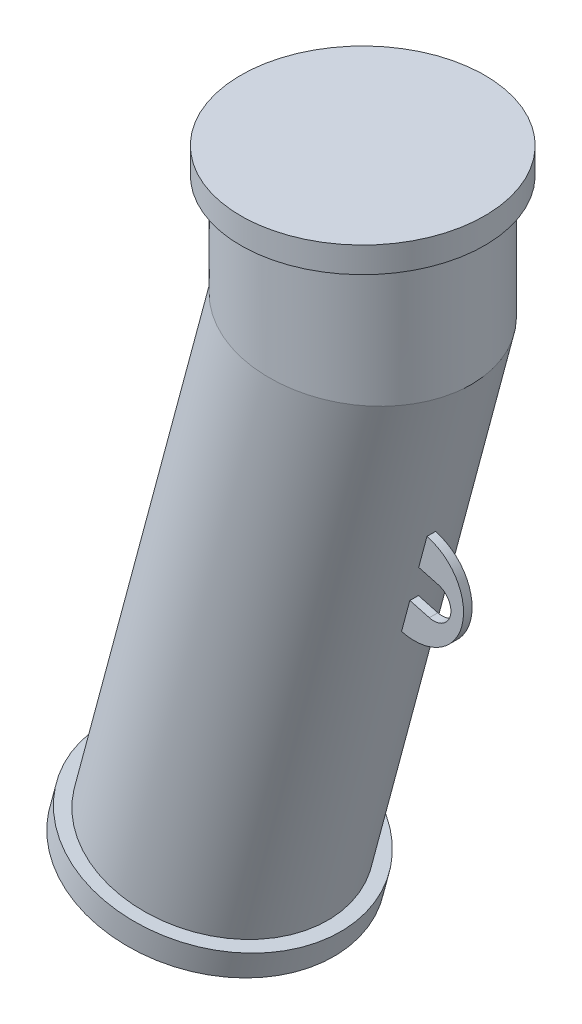
ISO-10303-21;
HEADER;
FILE_DESCRIPTION(('STEP AP214'),'2;1');
FILE_NAME('part.step','',(''),(''),'','','');
FILE_SCHEMA(('AUTOMOTIVE_DESIGN { 1 0 10303 214 1 1 1 1 }'));
ENDSEC;
DATA;
#1=APPLICATION_CONTEXT('core data for automotive mechanical design processes');
#2=APPLICATION_PROTOCOL_DEFINITION('international standard','automotive_design',2000,#1);
#3=PRODUCT_CONTEXT('',#1,'mechanical');
#4=PRODUCT('Part','Part','',(#3));
#5=PRODUCT_RELATED_PRODUCT_CATEGORY('part','',(#4));
#6=PRODUCT_DEFINITION_FORMATION('','',#4);
#7=PRODUCT_DEFINITION_CONTEXT('part definition',#1,'design');
#8=PRODUCT_DEFINITION('design','',#6,#7);
#9=PRODUCT_DEFINITION_SHAPE('','',#8);
#10=(LENGTH_UNIT() NAMED_UNIT(*) SI_UNIT(.MILLI.,.METRE.));
#11=(NAMED_UNIT(*) PLANE_ANGLE_UNIT() SI_UNIT($,.RADIAN.));
#12=(NAMED_UNIT(*) SI_UNIT($,.STERADIAN.) SOLID_ANGLE_UNIT());
#13=UNCERTAINTY_MEASURE_WITH_UNIT(LENGTH_MEASURE(1.E-05),#10,'distance_accuracy_value','');
#14=(GEOMETRIC_REPRESENTATION_CONTEXT(3) GLOBAL_UNCERTAINTY_ASSIGNED_CONTEXT((#13)) GLOBAL_UNIT_ASSIGNED_CONTEXT((#10,
#11,#12)) REPRESENTATION_CONTEXT('',''));
#15=CARTESIAN_POINT('',(0.,0.,0.));
#16=DIRECTION('',(0.,0.,1.));
#17=DIRECTION('',(1.,0.,0.));
#18=AXIS2_PLACEMENT_3D('',#15,#16,#17);
#19=CARTESIAN_POINT('',(-95.6613645989103,-759.954897245026,29.08394085975));
#20=DIRECTION('',(-0.258819045102508,-0.965925826289071,0.));
#21=DIRECTION('',(0.369643810614397,-0.0990457605412857,-0.923879532511309));
#22=AXIS2_PLACEMENT_3D('',#19,#20,#21);
#23=PLANE('',#22);
#24=CARTESIAN_POINT('',(-163.483696262181,-741.781958247051,1.65769548314787E-12));
#25=DIRECTION('',(0.258819045102508,0.965925826289071,0.));
#26=DIRECTION('',(-0.369643810614397,0.0990457605412857,0.923879532511309));
#27=AXIS2_PLACEMENT_3D('',#24,#25,#26);
#28=CIRCLE('',#27,142.5);
#29=CARTESIAN_POINT('',(-216.157939274733,-727.667937369918,131.652833382863));
#30=VERTEX_POINT('',#29);
#31=EDGE_CURVE('E10',#30,#30,#28,.T.);
#32=ORIENTED_EDGE('',*,*,#31,.T.);
#33=EDGE_LOOP('',(#32));
#34=FACE_BOUND('',#33,.T.);
#35=CARTESIAN_POINT('',(-163.483696262193,-741.781958247057,0.));
#36=DIRECTION('',(-0.258819045102522,-0.965925826289068,0.));
#37=DIRECTION('',(0.,0.,-1.));
#38=AXIS2_PLACEMENT_3D('',#35,#36,#37);
#39=CIRCLE('',#38,127.);
#40=CARTESIAN_POINT('',(-163.483696262193,-741.781958247057,-127.));
#41=VERTEX_POINT('',#40);
#42=EDGE_CURVE('E307',#41,#41,#39,.T.);
#43=ORIENTED_EDGE('',*,*,#42,.T.);
#44=EDGE_LOOP('',(#43));
#45=FACE_BOUND('',#44,.T.);
#46=ADVANCED_FACE('F17',(#34,#45),#23,.F.);
#47=CARTESIAN_POINT('',(-163.483696262181,-741.781958247051,1.65769548314787E-12));
#48=DIRECTION('',(0.258819045102508,0.965925826289071,0.));
#49=DIRECTION('',(-0.369643810614397,0.0990457605412857,0.923879532511309));
#50=AXIS2_PLACEMENT_3D('',#47,#48,#49);
#51=CYLINDRICAL_SURFACE('',#50,142.5);
#52=ORIENTED_EDGE('',*,*,#31,.F.);
#53=EDGE_LOOP('',(#52));
#54=FACE_BOUND('',#53,.T.);
#55=CARTESIAN_POINT('',(-171.248267615256,-770.759733035724,2.98976650334682E-12));
#56=DIRECTION('',(0.258819045102508,0.965925826289071,0.));
#57=DIRECTION('',(-0.369643810614397,0.0990457605412857,0.923879532511309));
#58=AXIS2_PLACEMENT_3D('',#55,#56,#57);
#59=CIRCLE('',#58,142.5);
#60=CARTESIAN_POINT('',(-223.922510627807,-756.645712158591,131.652833382865));
#61=VERTEX_POINT('',#60);
#62=EDGE_CURVE('E26',#61,#61,#59,.T.);
#63=ORIENTED_EDGE('',*,*,#62,.T.);
#64=EDGE_LOOP('',(#63));
#65=FACE_BOUND('',#64,.T.);
#66=ADVANCED_FACE('F397',(#54,#65),#51,.T.);
#67=CARTESIAN_POINT('',(-163.483696262193,-741.781958247057,0.));
#68=DIRECTION('',(0.258819045102522,0.965925826289068,0.));
#69=DIRECTION('',(-0.965925826289068,0.258819045102522,0.));
#70=AXIS2_PLACEMENT_3D('',#67,#68,#69);
#71=CYLINDRICAL_SURFACE('',#70,127.);
#72=CARTESIAN_POINT('',(50.3275105863922,-434.137557581643,4.99999999999997));
#73=CARTESIAN_POINT('',(50.3909015789031,-434.154601332665,3.33333333333331));
#74=CARTESIAN_POINT('',(50.4225970751586,-434.163123208177,1.66666666666665));
#75=CARTESIAN_POINT('',(50.4225970751586,-434.163123208177,-1.66666666666667));
#76=CARTESIAN_POINT('',(50.3909015789031,-434.154601332665,-3.33333333333333));
#77=CARTESIAN_POINT('',(50.3275105863922,-434.137557581643,-4.99999999999998));
#78=B_SPLINE_CURVE_WITH_KNOTS('',3,(#72,#73,#74,#75,#76,#77),.UNSPECIFIED.,.F.,.F.,(4,2,4),(0.,
5.00096941018497,10.0019388203699),.UNSPECIFIED.);
#79=CARTESIAN_POINT('',(50.3275105863922,-434.137557581643,4.99999999999997));
#80=VERTEX_POINT('',#79);
#81=CARTESIAN_POINT('',(50.327510586392,-434.137557581643,-5.00000000000001));
#82=VERTEX_POINT('',#81);
#83=EDGE_CURVE('E45',#80,#82,#78,.T.);
#84=ORIENTED_EDGE('',*,*,#83,.F.);
#85=DIRECTION('',(0.258819045102522,0.965925826289068,0.));
#86=VECTOR('',#85,1.);
#87=CARTESIAN_POINT('',(-40.9062246319123,-774.626492780639,5.00000000000005));
#88=LINE('',#87,#86);
#89=CARTESIAN_POINT('',(60.0332029580722,-397.915420527899,4.99999999999994));
#90=VERTEX_POINT('',#89);
#91=EDGE_CURVE('E38',#80,#90,#88,.T.);
#92=ORIENTED_EDGE('',*,*,#91,.T.);
#93=CARTESIAN_POINT('',(-62.5442686722088,-365.070885994318,0.));
#94=DIRECTION('',(-0.25881904510251,-0.96592582628907,0.));
#95=DIRECTION('',(0.965925826289071,-0.25881904510251,0.));
#96=AXIS2_PLACEMENT_3D('',#93,#94,#95);
#97=CIRCLE('',#96,127.);
#98=CARTESIAN_POINT('',(60.0332029580721,-397.915420527899,-4.99999999999996));
#99=VERTEX_POINT('',#98);
#100=EDGE_CURVE('E353',#99,#90,#97,.T.);
#101=ORIENTED_EDGE('',*,*,#100,.F.);
#102=DIRECTION('',(0.258819045102522,0.965925826289068,0.));
#103=VECTOR('',#102,1.);
#104=CARTESIAN_POINT('',(-40.9062246319123,-774.626492780639,-4.9999999999999));
#105=LINE('',#104,#103);
#106=EDGE_CURVE('E320',#82,#99,#105,.T.);
#107=ORIENTED_EDGE('',*,*,#106,.F.);
#108=EDGE_LOOP('',(#84,#92,#101,#107));
#109=FACE_BOUND('',#108,.T.);
#110=CARTESIAN_POINT('',(-52.1915068681081,-326.433852942755,0.));
#111=DIRECTION('',(0.258819045102511,0.96592582628907,0.));
#112=DIRECTION('',(-0.965925826289071,0.258819045102511,0.));
#113=AXIS2_PLACEMENT_3D('',#110,#111,#112);
#114=CIRCLE('',#113,127.);
#115=CARTESIAN_POINT('',(70.3859647621728,-359.278387476337,4.99999999999995));
#116=VERTEX_POINT('',#115);
#117=CARTESIAN_POINT('',(70.3859647621729,-359.278387476337,-4.99999999999996));
#118=VERTEX_POINT('',#117);
#119=EDGE_CURVE('E329',#116,#118,#114,.T.);
#120=ORIENTED_EDGE('',*,*,#119,.F.);
#121=CARTESIAN_POINT('',(80.0916571338533,-323.056250422592,4.99999999999997));
#122=VERTEX_POINT('',#121);
#123=EDGE_CURVE('E354',#116,#122,#88,.T.);
#124=ORIENTED_EDGE('',*,*,#123,.T.);
#125=CARTESIAN_POINT('',(80.0916571338533,-323.056250422592,-4.99999999999999));
#126=CARTESIAN_POINT('',(80.1550772192502,-323.073185597487,-3.33333333333333));
#127=CARTESIAN_POINT('',(80.1867872619486,-323.081653184934,-1.66666666666667));
#128=CARTESIAN_POINT('',(80.1867872619486,-323.081653184934,1.66666666666665));
#129=CARTESIAN_POINT('',(80.1550772192501,-323.073185597487,3.33333333333331));
#130=CARTESIAN_POINT('',(80.0916571338533,-323.056250422593,4.99999999999996));
#131=B_SPLINE_CURVE_WITH_KNOTS('',3,(#125,#126,#127,#128,#129,#130),.UNSPECIFIED.,.F.,.F.,(4,2,
4),(0.,5.00096941018496,10.0019388203699),.UNSPECIFIED.);
#132=CARTESIAN_POINT('',(80.0916571338532,-323.056250422593,-5.00000000000001));
#133=VERTEX_POINT('',#132);
#134=EDGE_CURVE('E319',#133,#122,#131,.T.);
#135=ORIENTED_EDGE('',*,*,#134,.F.);
#136=EDGE_CURVE('E315',#118,#133,#105,.T.);
#137=ORIENTED_EDGE('',*,*,#136,.F.);
#138=EDGE_LOOP('',(#120,#124,#135,#137));
#139=FACE_BOUND('',#138,.T.);
#140=ORIENTED_EDGE('',*,*,#42,.F.);
#141=EDGE_LOOP('',(#140));
#142=FACE_BOUND('',#141,.T.);
#143=CARTESIAN_POINT('',(1.17961196366423E-13,-131.652497587396,0.));
#144=DIRECTION('',(0.130526192220051,0.99144486137381,0.));
#145=DIRECTION('',(0.991444861373811,-0.130526192220052,0.));
#146=AXIS2_PLACEMENT_3D('',#143,#144,#145);
#147=ELLIPSE('',#146,128.095877993679,127.);
#148=CARTESIAN_POINT('',(127.,-148.372364780996,0.));
#149=VERTEX_POINT('',#148);
#150=EDGE_CURVE('E311',#149,#149,#147,.T.);
#151=ORIENTED_EDGE('',*,*,#150,.F.);
#152=EDGE_LOOP('',(#151));
#153=FACE_BOUND('',#152,.T.);
#154=ADVANCED_FACE('F331',(#109,#139,#142,#153),#71,.T.);
#155=CARTESIAN_POINT('',(65.3046921685573,-378.622388196556,4.99999999999997));
#156=DIRECTION('',(0.,0.,-0.999999999999999));
#157=DIRECTION('',(-0.965925826289069,0.25881904510251,0.));
#158=AXIS2_PLACEMENT_3D('',#155,#156,#157);
#159=CYLINDRICAL_SURFACE('',#158,57.5);
#160=CARTESIAN_POINT('',(65.3046921685573,-378.622388196556,4.99999999999997));
#161=DIRECTION('',(0.,0.,0.999999999999999));
#162=DIRECTION('',(0.965925826289069,-0.25881904510251,0.));
#163=AXIS2_PLACEMENT_3D('',#160,#161,#162);
#164=CIRCLE('',#163,57.5);
#165=EDGE_CURVE('E284',#80,#122,#164,.T.);
#166=ORIENTED_EDGE('',*,*,#165,.F.);
#167=ORIENTED_EDGE('',*,*,#83,.T.);
#168=CARTESIAN_POINT('',(65.3046921685571,-378.622388196556,-5.00000000000001));
#169=DIRECTION('',(0.,0.,0.999999999999999));
#170=DIRECTION('',(0.965925826289069,-0.25881904510251,0.));
#171=AXIS2_PLACEMENT_3D('',#168,#169,#170);
#172=CIRCLE('',#171,57.5);
#173=EDGE_CURVE('E277',#82,#133,#172,.T.);
#174=ORIENTED_EDGE('',*,*,#173,.T.);
#175=ORIENTED_EDGE('',*,*,#134,.T.);
#176=EDGE_LOOP('',(#166,#167,#174,#175));
#177=FACE_BOUND('',#176,.T.);
#178=ADVANCED_FACE('F335',(#177),#159,.T.);
#179=CARTESIAN_POINT('',(88.0039490863505,-384.704635756466,4.99999999999995));
#180=DIRECTION('',(0.,0.,0.999999999999999));
#181=DIRECTION('',(0.965925826289069,-0.25881904510251,0.));
#182=AXIS2_PLACEMENT_3D('',#179,#180,#181);
#183=PLANE('',#182);
#184=ORIENTED_EDGE('',*,*,#91,.F.);
#185=ORIENTED_EDGE('',*,*,#165,.T.);
#186=ORIENTED_EDGE('',*,*,#123,.F.);
#187=DIRECTION('',(0.965925826289069,-0.25881904510251,0.));
#188=VECTOR('',#187,1.);
#189=CARTESIAN_POINT('',(70.4810730706073,-359.303871670775,4.99999999999997));
#190=LINE('',#189,#188);
#191=CARTESIAN_POINT('',(93.1803299884009,-365.386119230683,4.99999999999995));
#192=VERTEX_POINT('',#191);
#193=EDGE_CURVE('E273',#116,#192,#190,.T.);
#194=ORIENTED_EDGE('',*,*,#193,.T.);
#195=CARTESIAN_POINT('',(88.0039490863505,-384.704635756466,4.99999999999995));
#196=DIRECTION('',(0.,0.,-0.999999999999999));
#197=DIRECTION('',(0.965925826289069,-0.25881904510251,0.));
#198=AXIS2_PLACEMENT_3D('',#195,#196,#197);
#199=CIRCLE('',#198,20.);
#200=CARTESIAN_POINT('',(82.8275681843003,-404.023152282247,4.99999999999996));
#201=VERTEX_POINT('',#200);
#202=EDGE_CURVE('E276',#192,#201,#199,.T.);
#203=ORIENTED_EDGE('',*,*,#202,.T.);
#204=DIRECTION('',(-0.965925826289069,0.25881904510251,0.));
#205=VECTOR('',#204,1.);
#206=CARTESIAN_POINT('',(60.1283112665068,-397.940904722337,4.99999999999997));
#207=LINE('',#206,#205);
#208=EDGE_CURVE('E280',#201,#90,#207,.T.);
#209=ORIENTED_EDGE('',*,*,#208,.T.);
#210=EDGE_LOOP('',(#184,#185,#186,#194,#203,#209));
#211=FACE_BOUND('',#210,.T.);
#212=ADVANCED_FACE('F340',(#211),#183,.T.);
#213=CARTESIAN_POINT('',(88.0039490863506,-384.704635756466,-5.00000000000003));
#214=DIRECTION('',(0.,0.,0.999999999999999));
#215=DIRECTION('',(0.965925826289069,-0.25881904510251,0.));
#216=AXIS2_PLACEMENT_3D('',#213,#214,#215);
#217=PLANE('',#216);
#218=ORIENTED_EDGE('',*,*,#173,.F.);
#219=ORIENTED_EDGE('',*,*,#106,.T.);
#220=DIRECTION('',(-0.965925826289069,0.25881904510251,0.));
#221=VECTOR('',#220,1.);
#222=CARTESIAN_POINT('',(60.1283112665067,-397.940904722338,-5.00000000000001));
#223=LINE('',#222,#221);
#224=CARTESIAN_POINT('',(82.8275681843002,-404.023152282247,-5.00000000000002));
#225=VERTEX_POINT('',#224);
#226=EDGE_CURVE('E293',#225,#99,#223,.T.);
#227=ORIENTED_EDGE('',*,*,#226,.F.);
#228=CARTESIAN_POINT('',(88.0039490863506,-384.704635756466,-5.00000000000003));
#229=DIRECTION('',(0.,0.,-0.999999999999999));
#230=DIRECTION('',(0.965925826289069,-0.25881904510251,0.));
#231=AXIS2_PLACEMENT_3D('',#228,#229,#230);
#232=CIRCLE('',#231,20.);
#233=CARTESIAN_POINT('',(93.1803299884009,-365.386119230684,-5.00000000000003));
#234=VERTEX_POINT('',#233);
#235=EDGE_CURVE('E290',#234,#225,#232,.T.);
#236=ORIENTED_EDGE('',*,*,#235,.F.);
#237=DIRECTION('',(0.965925826289069,-0.25881904510251,0.));
#238=VECTOR('',#237,1.);
#239=CARTESIAN_POINT('',(70.4810730706072,-359.303871670775,-5.00000000000001));
#240=LINE('',#239,#238);
#241=EDGE_CURVE('E272',#118,#234,#240,.T.);
#242=ORIENTED_EDGE('',*,*,#241,.F.);
#243=ORIENTED_EDGE('',*,*,#136,.T.);
#244=EDGE_LOOP('',(#218,#219,#227,#236,#242,#243));
#245=FACE_BOUND('',#244,.T.);
#246=ADVANCED_FACE('F342',(#245),#217,.F.);
#247=CARTESIAN_POINT('',(70.4810730706073,-359.303871670775,4.99999999999997));
#248=DIRECTION('',(0.258819045102511,0.96592582628907,0.));
#249=DIRECTION('',(-0.965925826289069,0.25881904510251,0.));
#250=AXIS2_PLACEMENT_3D('',#247,#248,#249);
#251=PLANE('',#250);
#252=ORIENTED_EDGE('',*,*,#193,.F.);
#253=ORIENTED_EDGE('',*,*,#119,.T.);
#254=ORIENTED_EDGE('',*,*,#241,.T.);
#255=DIRECTION('',(0.,0.,-0.999999999999999));
#256=VECTOR('',#255,1.);
#257=CARTESIAN_POINT('',(93.1803299884009,-365.386119230683,4.99999999999995));
#258=LINE('',#257,#256);
#259=EDGE_CURVE('E303',#192,#234,#258,.T.);
#260=ORIENTED_EDGE('',*,*,#259,.F.);
#261=EDGE_LOOP('',(#252,#253,#254,#260));
#262=FACE_BOUND('',#261,.T.);
#263=ADVANCED_FACE('F381',(#262),#251,.F.);
#264=CARTESIAN_POINT('',(88.0039490863505,-384.704635756466,4.99999999999995));
#265=DIRECTION('',(0.,0.,-0.999999999999999));
#266=DIRECTION('',(-0.965925826289069,0.25881904510251,0.));
#267=AXIS2_PLACEMENT_3D('',#264,#265,#266);
#268=CYLINDRICAL_SURFACE('',#267,20.);
#269=ORIENTED_EDGE('',*,*,#235,.T.);
#270=DIRECTION('',(0.,0.,-0.999999999999999));
#271=VECTOR('',#270,1.);
#272=CARTESIAN_POINT('',(82.8275681843003,-404.023152282247,4.99999999999996));
#273=LINE('',#272,#271);
#274=EDGE_CURVE('E287',#201,#225,#273,.T.);
#275=ORIENTED_EDGE('',*,*,#274,.F.);
#276=ORIENTED_EDGE('',*,*,#202,.F.);
#277=ORIENTED_EDGE('',*,*,#259,.T.);
#278=EDGE_LOOP('',(#269,#275,#276,#277));
#279=FACE_BOUND('',#278,.T.);
#280=ADVANCED_FACE('F389',(#279),#268,.F.);
#281=CARTESIAN_POINT('',(60.1283112665068,-397.940904722337,4.99999999999997));
#282=DIRECTION('',(-0.25881904510251,-0.96592582628907,0.));
#283=DIRECTION('',(0.965925826289069,-0.25881904510251,0.));
#284=AXIS2_PLACEMENT_3D('',#281,#282,#283);
#285=PLANE('',#284);
#286=ORIENTED_EDGE('',*,*,#226,.T.);
#287=ORIENTED_EDGE('',*,*,#100,.T.);
#288=ORIENTED_EDGE('',*,*,#208,.F.);
#289=ORIENTED_EDGE('',*,*,#274,.T.);
#290=EDGE_LOOP('',(#286,#287,#288,#289));
#291=FACE_BOUND('',#290,.T.);
#292=ADVANCED_FACE('F344',(#291),#285,.F.);
#293=CARTESIAN_POINT('',(0.,-131.652497587396,0.));
#294=DIRECTION('',(0.,1.,0.));
#295=DIRECTION('',(0.,0.,1.));
#296=AXIS2_PLACEMENT_3D('',#293,#294,#295);
#297=CYLINDRICAL_SURFACE('',#296,127.);
#298=CARTESIAN_POINT('',(0.,0.,0.));
#299=DIRECTION('',(0.,-1.,0.));
#300=DIRECTION('',(0.,0.,-1.));
#301=AXIS2_PLACEMENT_3D('',#298,#299,#300);
#302=CIRCLE('',#301,127.);
#303=CARTESIAN_POINT('',(0.,0.,-127.));
#304=VERTEX_POINT('',#303);
#305=EDGE_CURVE('E268',#304,#304,#302,.T.);
#306=ORIENTED_EDGE('',*,*,#305,.T.);
#307=EDGE_LOOP('',(#306));
#308=FACE_BOUND('',#307,.T.);
#309=ORIENTED_EDGE('',*,*,#150,.T.);
#310=EDGE_LOOP('',(#309));
#311=FACE_BOUND('',#310,.T.);
#312=ADVANCED_FACE('F402',(#308,#311),#297,.T.);
#313=CARTESIAN_POINT('',(-70.2148444708592,6.66767336600093E-12,-29.0839408597462));
#314=DIRECTION('',(0.,1.,0.));
#315=DIRECTION('',(0.3826834323651,0.,-0.923879532511309));
#316=AXIS2_PLACEMENT_3D('',#313,#314,#315);
#317=PLANE('',#316);
#318=ORIENTED_EDGE('',*,*,#305,.F.);
#319=EDGE_LOOP('',(#318));
#320=FACE_BOUND('',#319,.T.);
#321=CARTESIAN_POINT('',(0.,0.,0.));
#322=DIRECTION('',(0.,-1.,0.));
#323=DIRECTION('',(-0.3826834323651,0.,0.923879532511309));
#324=AXIS2_PLACEMENT_3D('',#321,#322,#323);
#325=CIRCLE('',#324,142.5);
#326=CARTESIAN_POINT('',(-54.5323891120267,0.,131.652833382862));
#327=VERTEX_POINT('',#326);
#328=EDGE_CURVE('E264',#327,#327,#325,.T.);
#329=ORIENTED_EDGE('',*,*,#328,.T.);
#330=EDGE_LOOP('',(#329));
#331=FACE_BOUND('',#330,.T.);
#332=ADVANCED_FACE('F404',(#320,#331),#317,.F.);
#333=CARTESIAN_POINT('',(0.,0.,0.));
#334=DIRECTION('',(0.,-1.,0.));
#335=DIRECTION('',(-0.3826834323651,0.,0.923879532511309));
#336=AXIS2_PLACEMENT_3D('',#333,#334,#335);
#337=CYLINDRICAL_SURFACE('',#336,142.5);
#338=ORIENTED_EDGE('',*,*,#328,.F.);
#339=EDGE_LOOP('',(#338));
#340=FACE_BOUND('',#339,.T.);
#341=CARTESIAN_POINT('',(-1.46716398762016E-12,30.0000000000009,4.29842939782631E-13));
#342=DIRECTION('',(0.,-1.,0.));
#343=DIRECTION('',(-0.3826834323651,0.,0.923879532511309));
#344=AXIS2_PLACEMENT_3D('',#341,#342,#343);
#345=CIRCLE('',#344,142.5);
#346=CARTESIAN_POINT('',(-54.5323891120282,30.0000000000008,131.652833382862));
#347=VERTEX_POINT('',#346);
#348=EDGE_CURVE('E233',#347,#347,#345,.T.);
#349=ORIENTED_EDGE('',*,*,#348,.T.);
#350=EDGE_LOOP('',(#349));
#351=FACE_BOUND('',#350,.T.);
#352=ADVANCED_FACE('F412',(#340,#351),#337,.T.);
#353=CARTESIAN_POINT('',(-131.652833382863,30.0000000000065,-54.5323891120248));
#354=DIRECTION('',(0.,-1.,0.));
#355=DIRECTION('',(-0.3826834323651,0.,0.923879532511309));
#356=AXIS2_PLACEMENT_3D('',#353,#354,#355);
#357=PLANE('',#356);
#358=ORIENTED_EDGE('',*,*,#348,.F.);
#359=EDGE_LOOP('',(#358));
#360=FACE_BOUND('',#359,.T.);
#361=ADVANCED_FACE('F427',(#360),#357,.F.);
#362=CARTESIAN_POINT('',(-82.2314573072118,-794.611715470564,38.1726723784205));
#363=DIRECTION('',(0.258819045102508,0.965925826289071,0.));
#364=DIRECTION('',(-0.369643810614397,0.0990457605412857,0.923879532511309));
#365=AXIS2_PLACEMENT_3D('',#362,#363,#364);
#366=PLANE('',#365);
#367=ORIENTED_EDGE('',*,*,#62,.F.);
#368=EDGE_LOOP('',(#367));
#369=FACE_BOUND('',#368,.T.);
#370=ADVANCED_FACE('F425',(#369),#366,.F.);
#371=CLOSED_SHELL('',(#46,#66,#154,#178,#212,#246,#263,#280,#292,#312,#332,#352,#361,#370));
#372=CARTESIAN_POINT('',(-164.777791487695,-746.611587378503,2.93576713832356E-12));
#373=DIRECTION('',(-0.258819045102509,-0.965925826289072,0.));
#374=DIRECTION('',(0.965925826289072,-0.258819045102509,0.));
#375=AXIS2_PLACEMENT_3D('',#372,#373,#374);
#376=PLANE('',#375);
#377=CARTESIAN_POINT('',(-164.777791487695,-746.611587378503,1.66849535615254E-12));
#378=DIRECTION('',(-0.258819045102509,-0.965925826289072,0.));
#379=DIRECTION('',(0.965925826289072,-0.258819045102509,0.));
#380=AXIS2_PLACEMENT_3D('',#377,#378,#379);
#381=CIRCLE('',#380,76.);
#382=CARTESIAN_POINT('',(-91.3674286897258,-766.281834806294,1.66849535615254E-12));
#383=VERTEX_POINT('',#382);
#384=EDGE_CURVE('E191',#383,#383,#381,.F.);
#385=ORIENTED_EDGE('',*,*,#384,.T.);
#386=EDGE_LOOP('',(#385));
#387=FACE_BOUND('',#386,.T.);
#388=ADVANCED_FACE('F574',(#387),#376,.F.);
#389=CARTESIAN_POINT('',(-1.42701282932674E-12,5.00000000000658,3.826491098729E-13));
#390=DIRECTION('',(0.,1.,0.));
#391=DIRECTION('',(0.,0.,1.));
#392=AXIS2_PLACEMENT_3D('',#389,#390,#391);
#393=PLANE('',#392);
#394=CARTESIAN_POINT('',(0.,5.00000000000658,0.));
#395=DIRECTION('',(0.,1.,0.));
#396=DIRECTION('',(0.,0.,1.));
#397=AXIS2_PLACEMENT_3D('',#394,#395,#396);
#398=CIRCLE('',#397,76.);
#399=CARTESIAN_POINT('',(0.,5.00000000000644,76.));
#400=VERTEX_POINT('',#399);
#401=EDGE_CURVE('E178',#400,#400,#398,.F.);
#402=ORIENTED_EDGE('',*,*,#401,.T.);
#403=EDGE_LOOP('',(#402));
#404=FACE_BOUND('',#403,.T.);
#405=ADVANCED_FACE('F560',(#404),#393,.F.);
#406=CARTESIAN_POINT('',(0.,0.,0.));
#407=DIRECTION('',(0.,-1.,0.));
#408=DIRECTION('',(-0.3826834323651,0.,0.923879532511309));
#409=AXIS2_PLACEMENT_3D('',#406,#407,#408);
#410=CYLINDRICAL_SURFACE('',#409,76.);
#411=CARTESIAN_POINT('',(2.28258002922504E-13,2.00000000000067,1.02131413259371E-13));
#412=DIRECTION('',(0.,1.,0.));
#413=DIRECTION('',(0.3826834323651,0.,-0.923879532511309));
#414=AXIS2_PLACEMENT_3D('',#411,#412,#413);
#415=CIRCLE('',#414,76.);
#416=CARTESIAN_POINT('',(29.0839408597478,2.00000000000071,-70.2148444708594));
#417=VERTEX_POINT('',#416);
#418=EDGE_CURVE('E202',#417,#417,#415,.F.);
#419=ORIENTED_EDGE('',*,*,#418,.T.);
#420=EDGE_LOOP('',(#419));
#421=FACE_BOUND('',#420,.T.);
#422=ORIENTED_EDGE('',*,*,#401,.F.);
#423=EDGE_LOOP('',(#422));
#424=FACE_BOUND('',#423,.T.);
#425=ADVANCED_FACE('F556',(#421,#424),#410,.F.);
#426=CARTESIAN_POINT('',(2.28258002922504E-13,2.00000000000067,1.02131413259371E-13));
#427=DIRECTION('',(0.,-1.,0.));
#428=DIRECTION('',(-0.3826834323651,0.,0.923879532511309));
#429=AXIS2_PLACEMENT_3D('',#426,#427,#428);
#430=CONICAL_SURFACE('',#429,76.,0.785398163397438);
#431=CARTESIAN_POINT('',(2.28579212188852E-13,1.80000000000067,1.01753862620093E-13));
#432=DIRECTION('',(0.,-1.,0.));
#433=DIRECTION('',(0.,0.,-1.));
#434=AXIS2_PLACEMENT_3D('',#431,#432,#433);
#435=CIRCLE('',#434,76.2);
#436=CARTESIAN_POINT('',(2.28579212188852E-13,1.80000000000082,-76.1999999999999));
#437=VERTEX_POINT('',#436);
#438=EDGE_CURVE('E198',#437,#437,#435,.F.);
#439=ORIENTED_EDGE('',*,*,#438,.F.);
#440=EDGE_LOOP('',(#439));
#441=FACE_BOUND('',#440,.T.);
#442=ORIENTED_EDGE('',*,*,#418,.F.);
#443=EDGE_LOOP('',(#442));
#444=FACE_BOUND('',#443,.T.);
#445=ADVANCED_FACE('F552',(#441,#444),#430,.F.);
#446=CARTESIAN_POINT('',(0.,10.,0.));
#447=DIRECTION('',(0.,-1.,0.));
#448=DIRECTION('',(1.,0.,0.));
#449=AXIS2_PLACEMENT_3D('',#446,#447,#448);
#450=CYLINDRICAL_SURFACE('',#449,76.2);
#451=ORIENTED_EDGE('',*,*,#438,.T.);
#452=EDGE_LOOP('',(#451));
#453=FACE_BOUND('',#452,.T.);
#454=CARTESIAN_POINT('',(0.,0.,0.));
#455=DIRECTION('',(0.,-1.,0.));
#456=DIRECTION('',(1.,0.,0.));
#457=AXIS2_PLACEMENT_3D('',#454,#455,#456);
#458=CIRCLE('',#457,76.2);
#459=CARTESIAN_POINT('',(76.2,0.,0.));
#460=VERTEX_POINT('',#459);
#461=EDGE_CURVE('E203',#460,#460,#458,.T.);
#462=ORIENTED_EDGE('',*,*,#461,.T.);
#463=EDGE_LOOP('',(#462));
#464=FACE_BOUND('',#463,.T.);
#465=ADVANCED_FACE('F555',(#453,#464),#450,.F.);
#466=CARTESIAN_POINT('',(-1000.,0.,0.));
#467=DIRECTION('',(0.,0.,-1.));
#468=DIRECTION('',(0.,1.,0.));
#469=AXIS2_PLACEMENT_3D('',#466,#467,#468);
#470=TOROIDAL_SURFACE('',#469,1000.,76.2);
#471=CARTESIAN_POINT('',(-34.0741737109319,-258.819045102521,0.));
#472=DIRECTION('',(-0.258819045102521,-0.965925826289068,0.));
#473=DIRECTION('',(0.965925826289068,-0.258819045102521,0.));
#474=AXIS2_PLACEMENT_3D('',#471,#472,#473);
#475=CIRCLE('',#474,76.2);
#476=CARTESIAN_POINT('',(39.5293742522951,-278.541056339334,0.));
#477=VERTEX_POINT('',#476);
#478=EDGE_CURVE('E197',#477,#477,#475,.T.);
#479=CARTESIAN_POINT('',(-1000.,0.,0.));
#480=DIRECTION('',(0.,0.,-1.));
#481=DIRECTION('',(0.,1.,0.));
#482=AXIS2_PLACEMENT_3D('',#479,#480,#481);
#483=CIRCLE('',#482,1076.2);
#484=EDGE_CURVE('',#460,#477,#483,.T.);
#485=ORIENTED_EDGE('',*,*,#461,.F.);
#486=ORIENTED_EDGE('',*,*,#478,.T.);
#487=ORIENTED_EDGE('',*,*,#484,.T.);
#488=ORIENTED_EDGE('',*,*,#484,.F.);
#489=EDGE_LOOP('',(#485,#487,#486,#488));
#490=FACE_BOUND('',#489,.T.);
#491=ADVANCED_FACE('F564',(#490),#470,.F.);
#492=CARTESIAN_POINT('',(-34.0741737109319,-258.819045102522,0.));
#493=DIRECTION('',(-0.258819045102522,-0.965925826289068,0.));
#494=DIRECTION('',(-0.933012701892219,0.250000000000001,0.258819045102521));
#495=AXIS2_PLACEMENT_3D('',#492,#493,#494);
#496=CYLINDRICAL_SURFACE('',#495,76.2);
#497=ORIENTED_EDGE('',*,*,#478,.F.);
#498=EDGE_LOOP('',(#497));
#499=FACE_BOUND('',#498,.T.);
#500=CARTESIAN_POINT('',(-163.949570543366,-743.520624734372,1.56745749191392E-12));
#501=DIRECTION('',(0.258819045102508,0.965925826289071,0.));
#502=DIRECTION('',(-0.965925826289072,0.258819045102509,0.));
#503=AXIS2_PLACEMENT_3D('',#500,#501,#502);
#504=CIRCLE('',#503,76.2);
#505=CARTESIAN_POINT('',(-237.553118506593,-723.798613497561,1.56745749191392E-12));
#506=VERTEX_POINT('',#505);
#507=EDGE_CURVE('E192',#506,#506,#504,.F.);
#508=ORIENTED_EDGE('',*,*,#507,.T.);
#509=EDGE_LOOP('',(#508));
#510=FACE_BOUND('',#509,.T.);
#511=ADVANCED_FACE('F546',(#499,#510),#496,.F.);
#512=CARTESIAN_POINT('',(-164.001334352386,-743.71380989963,1.56788948683411E-12));
#513=DIRECTION('',(0.258819045102508,0.965925826289071,0.));
#514=DIRECTION('',(-0.369643810614397,0.0990457605412857,0.923879532511309));
#515=AXIS2_PLACEMENT_3D('',#512,#513,#514);
#516=CONICAL_SURFACE('',#515,76.,0.785398163397438);
#517=ORIENTED_EDGE('',*,*,#507,.F.);
#518=EDGE_LOOP('',(#517));
#519=FACE_BOUND('',#518,.T.);
#520=CARTESIAN_POINT('',(-164.001334352386,-743.71380989963,1.56788948683411E-12));
#521=DIRECTION('',(-0.258819045102508,-0.965925826289071,0.));
#522=DIRECTION('',(0.369643810614397,-0.0990457605412857,-0.923879532511309));
#523=AXIS2_PLACEMENT_3D('',#520,#521,#522);
#524=CIRCLE('',#523,76.);
#525=CARTESIAN_POINT('',(-135.908404745692,-751.241287700768,-70.214844470858));
#526=VERTEX_POINT('',#525);
#527=EDGE_CURVE('E196',#526,#526,#524,.F.);
#528=ORIENTED_EDGE('',*,*,#527,.F.);
#529=EDGE_LOOP('',(#528));
#530=FACE_BOUND('',#529,.T.);
#531=ADVANCED_FACE('F542',(#519,#530),#516,.F.);
#532=CARTESIAN_POINT('',(-163.483696262181,-741.781958247051,1.65769548314787E-12));
#533=DIRECTION('',(0.258819045102508,0.965925826289071,0.));
#534=DIRECTION('',(-0.369643810614397,0.0990457605412857,0.923879532511309));
#535=AXIS2_PLACEMENT_3D('',#532,#533,#534);
#536=CYLINDRICAL_SURFACE('',#535,76.);
#537=ORIENTED_EDGE('',*,*,#527,.T.);
#538=EDGE_LOOP('',(#537));
#539=FACE_BOUND('',#538,.T.);
#540=ORIENTED_EDGE('',*,*,#384,.F.);
#541=EDGE_LOOP('',(#540));
#542=FACE_BOUND('',#541,.T.);
#543=ADVANCED_FACE('F545',(#539,#542),#536,.F.);
#544=CLOSED_SHELL('',(#388,#405,#425,#445,#465,#491,#511,#531,#543));
#545=CARTESIAN_POINT('',(-45.9220118838119,5.00000000000672,-110.865543901357));
#546=DIRECTION('',(0.,1.,0.));
#547=DIRECTION('',(0.,0.,1.));
#548=AXIS2_PLACEMENT_3D('',#545,#546,#547);
#549=PLANE('',#548);
#550=CARTESIAN_POINT('',(-45.9220118838128,5.00000000000672,-110.865543901357));
#551=DIRECTION('',(0.,1.,0.));
#552=DIRECTION('',(0.,0.,1.));
#553=AXIS2_PLACEMENT_3D('',#550,#551,#552);
#554=CIRCLE('',#553,5.42144103529902);
#555=CARTESIAN_POINT('',(-45.9220118838128,5.00000000000671,-105.444102866058));
#556=VERTEX_POINT('',#555);
#557=EDGE_CURVE('E186',#556,#556,#554,.F.);
#558=ORIENTED_EDGE('',*,*,#557,.T.);
#559=EDGE_LOOP('',(#558));
#560=FACE_BOUND('',#559,.T.);
#561=ADVANCED_FACE('F581',(#560),#549,.F.);
#562=CARTESIAN_POINT('',(-45.9220118838128,7.00000000000668,-110.865543901357));
#563=DIRECTION('',(0.,1.,0.));
#564=DIRECTION('',(0.923879532511311,0.,-0.382683432365097));
#565=AXIS2_PLACEMENT_3D('',#562,#563,#564);
#566=CONICAL_SURFACE('',#565,8.74999999999998,1.02974425867665);
#567=CARTESIAN_POINT('',(-45.9220118838114,1.74246958351599,-110.865543901356));
#568=VERTEX_POINT('',#567);
#569=VERTEX_LOOP('',#568);
#570=FACE_BOUND('',#569,.T.);
#571=ORIENTED_EDGE('',*,*,#557,.F.);
#572=EDGE_LOOP('',(#571));
#573=FACE_BOUND('',#572,.T.);
#574=ADVANCED_FACE('F578',(#570,#573),#566,.F.);
#575=CLOSED_SHELL('',(#561,#574));
#576=CARTESIAN_POINT('',(45.9220118838111,5.00000000000687,-110.865543901355));
#577=DIRECTION('',(0.,1.,0.));
#578=DIRECTION('',(0.,0.,1.));
#579=AXIS2_PLACEMENT_3D('',#576,#577,#578);
#580=PLANE('',#579);
#581=CARTESIAN_POINT('',(45.9220118838117,5.00000000000687,-110.865543901356));
#582=DIRECTION('',(0.,1.,0.));
#583=DIRECTION('',(0.,0.,1.));
#584=AXIS2_PLACEMENT_3D('',#581,#582,#583);
#585=CIRCLE('',#584,5.42144103531128);
#586=CARTESIAN_POINT('',(45.9220118838117,5.00000000000686,-105.444102866045));
#587=VERTEX_POINT('',#586);
#588=EDGE_CURVE('E190',#587,#587,#585,.F.);
#589=ORIENTED_EDGE('',*,*,#588,.T.);
#590=EDGE_LOOP('',(#589));
#591=FACE_BOUND('',#590,.T.);
#592=ADVANCED_FACE('F525',(#591),#580,.F.);
#593=CARTESIAN_POINT('',(45.9220118838117,6.99999999999946,-110.865543901356));
#594=DIRECTION('',(0.,1.,0.));
#595=DIRECTION('',(0.92387953251131,0.,0.382683432365103));
#596=AXIS2_PLACEMENT_3D('',#593,#594,#595);
#597=CONICAL_SURFACE('',#596,8.74999999999998,1.02974425867665);
#598=CARTESIAN_POINT('',(45.9220118838118,1.7424695835091,-110.865543901356));
#599=VERTEX_POINT('',#598);
#600=VERTEX_LOOP('',#599);
#601=FACE_BOUND('',#600,.T.);
#602=ORIENTED_EDGE('',*,*,#588,.F.);
#603=EDGE_LOOP('',(#602));
#604=FACE_BOUND('',#603,.T.);
#605=ADVANCED_FACE('F522',(#601,#604),#597,.F.);
#606=CLOSED_SHELL('',(#592,#605));
#607=CARTESIAN_POINT('',(110.865543901355,5.00000000000685,-45.9220118838082));
#608=DIRECTION('',(0.,1.,0.));
#609=DIRECTION('',(0.,0.,1.));
#610=AXIS2_PLACEMENT_3D('',#607,#608,#609);
#611=PLANE('',#610);
#612=CARTESIAN_POINT('',(110.865543901355,5.00000000000685,-45.9220118838108));
#613=DIRECTION('',(0.,1.,0.));
#614=DIRECTION('',(0.,0.,1.));
#615=AXIS2_PLACEMENT_3D('',#612,#613,#614);
#616=CIRCLE('',#615,5.42144103530627);
#617=CARTESIAN_POINT('',(110.865543901355,5.00000000000684,-40.5005708485045));
#618=VERTEX_POINT('',#617);
#619=EDGE_CURVE('E222',#618,#618,#616,.F.);
#620=ORIENTED_EDGE('',*,*,#619,.T.);
#621=EDGE_LOOP('',(#620));
#622=FACE_BOUND('',#621,.T.);
#623=ADVANCED_FACE('F535',(#622),#611,.F.);
#624=CARTESIAN_POINT('',(110.865543901355,7.00000000000244,-45.9220118838108));
#625=DIRECTION('',(0.,1.,0.));
#626=DIRECTION('',(0.382683432365094,0.,0.923879532511311));
#627=AXIS2_PLACEMENT_3D('',#624,#625,#626);
#628=CONICAL_SURFACE('',#627,8.74999999999998,1.02974425867665);
#629=CARTESIAN_POINT('',(110.865543901356,1.74246958351265,-45.9220118838092));
#630=VERTEX_POINT('',#629);
#631=VERTEX_LOOP('',#630);
#632=FACE_BOUND('',#631,.T.);
#633=ORIENTED_EDGE('',*,*,#619,.F.);
#634=EDGE_LOOP('',(#633));
#635=FACE_BOUND('',#634,.T.);
#636=ADVANCED_FACE('F532',(#632,#635),#628,.F.);
#637=CLOSED_SHELL('',(#623,#636));
#638=CARTESIAN_POINT('',(110.865543901356,5.00000000000667,45.9220118838136));
#639=DIRECTION('',(0.,1.,0.));
#640=DIRECTION('',(0.,0.,1.));
#641=AXIS2_PLACEMENT_3D('',#638,#639,#640);
#642=PLANE('',#641);
#643=CARTESIAN_POINT('',(110.865543901356,5.00000000000667,45.9220118838127));
#644=DIRECTION('',(0.,1.,0.));
#645=DIRECTION('',(0.,0.,1.));
#646=AXIS2_PLACEMENT_3D('',#643,#644,#645);
#647=CIRCLE('',#646,5.42144103530119);
#648=CARTESIAN_POINT('',(110.865543901356,5.00000000000666,51.3434529191139));
#649=VERTEX_POINT('',#648);
#650=EDGE_CURVE('E174',#649,#649,#647,.F.);
#651=ORIENTED_EDGE('',*,*,#650,.T.);
#652=EDGE_LOOP('',(#651));
#653=FACE_BOUND('',#652,.T.);
#654=ADVANCED_FACE('F621',(#653),#642,.F.);
#655=CARTESIAN_POINT('',(110.865543901356,7.00000000000532,45.9220118838127));
#656=DIRECTION('',(0.,1.,0.));
#657=DIRECTION('',(-0.3826834323651,0.,0.923879532511309));
#658=AXIS2_PLACEMENT_3D('',#655,#656,#657);
#659=CONICAL_SURFACE('',#658,8.74999999999998,1.02974425867665);
#660=CARTESIAN_POINT('',(110.865543901356,1.74246958351475,45.9220118838134));
#661=VERTEX_POINT('',#660);
#662=VERTEX_LOOP('',#661);
#663=FACE_BOUND('',#662,.T.);
#664=ORIENTED_EDGE('',*,*,#650,.F.);
#665=EDGE_LOOP('',(#664));
#666=FACE_BOUND('',#665,.T.);
#667=ADVANCED_FACE('F618',(#663,#666),#659,.F.);
#668=CLOSED_SHELL('',(#654,#667));
#669=CARTESIAN_POINT('',(45.9220118838096,5.00000000000645,110.865543901359));
#670=DIRECTION('',(0.,1.,0.));
#671=DIRECTION('',(0.,0.,1.));
#672=AXIS2_PLACEMENT_3D('',#669,#670,#671);
#673=PLANE('',#672);
#674=CARTESIAN_POINT('',(45.9220118838101,5.00000000000645,110.865543901359));
#675=DIRECTION('',(0.,1.,0.));
#676=DIRECTION('',(0.,0.,1.));
#677=AXIS2_PLACEMENT_3D('',#674,#675,#676);
#678=CIRCLE('',#677,5.42144103530045);
#679=CARTESIAN_POINT('',(45.9220118838101,5.00000000000644,116.28698493666));
#680=VERTEX_POINT('',#679);
#681=EDGE_CURVE('E179',#680,#680,#678,.F.);
#682=ORIENTED_EDGE('',*,*,#681,.T.);
#683=EDGE_LOOP('',(#682));
#684=FACE_BOUND('',#683,.T.);
#685=ADVANCED_FACE('F611',(#684),#673,.F.);
#686=CARTESIAN_POINT('',(45.9220118838101,7.00000000000555,110.865543901359));
#687=DIRECTION('',(0.,1.,0.));
#688=DIRECTION('',(-0.923879532511311,0.,0.382683432365091));
#689=AXIS2_PLACEMENT_3D('',#686,#687,#688);
#690=CONICAL_SURFACE('',#689,8.74999999999998,1.02974425867665);
#691=CARTESIAN_POINT('',(45.9220118838093,1.74246958351586,110.865543901358));
#692=VERTEX_POINT('',#691);
#693=VERTEX_LOOP('',#692);
#694=FACE_BOUND('',#693,.T.);
#695=ORIENTED_EDGE('',*,*,#681,.F.);
#696=EDGE_LOOP('',(#695));
#697=FACE_BOUND('',#696,.T.);
#698=ADVANCED_FACE('F608',(#694,#697),#690,.F.);
#699=CLOSED_SHELL('',(#685,#698));
#700=CARTESIAN_POINT('',(-45.922011883814,5.0000000000063,110.865543901357));
#701=DIRECTION('',(0.,1.,0.));
#702=DIRECTION('',(0.,0.,1.));
#703=AXIS2_PLACEMENT_3D('',#700,#701,#702);
#704=PLANE('',#703);
#705=CARTESIAN_POINT('',(-45.9220118838142,5.0000000000063,110.865543901355));
#706=DIRECTION('',(0.,1.,0.));
#707=DIRECTION('',(0.,0.,1.));
#708=AXIS2_PLACEMENT_3D('',#705,#706,#707);
#709=CIRCLE('',#708,5.42144103530924);
#710=CARTESIAN_POINT('',(-45.9220118838142,5.00000000000629,116.286984936664));
#711=VERTEX_POINT('',#710);
#712=EDGE_CURVE('E171',#711,#711,#709,.F.);
#713=ORIENTED_EDGE('',*,*,#712,.T.);
#714=EDGE_LOOP('',(#713));
#715=FACE_BOUND('',#714,.T.);
#716=ADVANCED_FACE('F601',(#715),#704,.F.);
#717=CARTESIAN_POINT('',(-45.9220118838142,7.00000000000011,110.865543901355));
#718=DIRECTION('',(0.,1.,0.));
#719=DIRECTION('',(-0.923879532511307,0.,-0.382683432365109));
#720=AXIS2_PLACEMENT_3D('',#717,#718,#719);
#721=CONICAL_SURFACE('',#720,8.74999999999998,1.02974425867665);
#722=CARTESIAN_POINT('',(-45.9220118838142,1.74246958350943,110.865543901359));
#723=VERTEX_POINT('',#722);
#724=VERTEX_LOOP('',#723);
#725=FACE_BOUND('',#724,.T.);
#726=ORIENTED_EDGE('',*,*,#712,.F.);
#727=EDGE_LOOP('',(#726));
#728=FACE_BOUND('',#727,.T.);
#729=ADVANCED_FACE('F598',(#725,#728),#721,.F.);
#730=CLOSED_SHELL('',(#716,#729));
#731=CARTESIAN_POINT('',(-110.865543901359,5.00000000000632,45.922011883812));
#732=DIRECTION('',(0.,1.,0.));
#733=DIRECTION('',(0.,0.,1.));
#734=AXIS2_PLACEMENT_3D('',#731,#732,#733);
#735=PLANE('',#734);
#736=CARTESIAN_POINT('',(-110.86554390136,5.00000000000632,45.9220118838121));
#737=DIRECTION('',(0.,1.,0.));
#738=DIRECTION('',(0.,0.,1.));
#739=AXIS2_PLACEMENT_3D('',#736,#737,#738);
#740=CIRCLE('',#739,5.42144103529651);
#741=CARTESIAN_POINT('',(-110.86554390136,5.00000000000631,51.3434529191086));
#742=VERTEX_POINT('',#741);
#743=EDGE_CURVE('E162',#742,#742,#740,.F.);
#744=ORIENTED_EDGE('',*,*,#743,.T.);
#745=EDGE_LOOP('',(#744));
#746=FACE_BOUND('',#745,.T.);
#747=ADVANCED_FACE('F591',(#746),#735,.F.);
#748=CARTESIAN_POINT('',(-110.86554390136,7.00000000000778,45.9220118838121));
#749=DIRECTION('',(0.,1.,0.));
#750=DIRECTION('',(-0.382683432365088,0.,-0.923879532511314));
#751=AXIS2_PLACEMENT_3D('',#748,#749,#750);
#752=CONICAL_SURFACE('',#751,8.74999999999998,1.02974425867665);
#753=CARTESIAN_POINT('',(-110.865543901358,1.74246958351843,45.9220118838127));
#754=VERTEX_POINT('',#753);
#755=VERTEX_LOOP('',#754);
#756=FACE_BOUND('',#755,.T.);
#757=ORIENTED_EDGE('',*,*,#743,.F.);
#758=EDGE_LOOP('',(#757));
#759=FACE_BOUND('',#758,.T.);
#760=ADVANCED_FACE('F588',(#756,#759),#752,.F.);
#761=CLOSED_SHELL('',(#747,#760));
#762=CARTESIAN_POINT('',(-110.865543901357,5.00000000000649,-45.9220118838119));
#763=DIRECTION('',(0.,1.,0.));
#764=DIRECTION('',(0.,0.,1.));
#765=AXIS2_PLACEMENT_3D('',#762,#763,#764);
#766=PLANE('',#765);
#767=CARTESIAN_POINT('',(-110.865543901358,5.00000000000649,-45.9220118838094));
#768=DIRECTION('',(0.,1.,0.));
#769=DIRECTION('',(0.,0.,1.));
#770=AXIS2_PLACEMENT_3D('',#767,#768,#769);
#771=CIRCLE('',#770,5.42144103529938);
#772=CARTESIAN_POINT('',(-110.865543901358,5.00000000000648,-40.5005708485101));
#773=VERTEX_POINT('',#772);
#774=EDGE_CURVE('E246',#773,#773,#771,.F.);
#775=ORIENTED_EDGE('',*,*,#774,.T.);
#776=EDGE_LOOP('',(#775));
#777=FACE_BOUND('',#776,.T.);
#778=ADVANCED_FACE('F455',(#777),#766,.F.);
#779=CARTESIAN_POINT('',(-110.865543901358,7.00000000000623,-45.9220118838094));
#780=DIRECTION('',(0.,1.,0.));
#781=DIRECTION('',(0.3826834323651,0.,-0.923879532511309));
#782=AXIS2_PLACEMENT_3D('',#779,#780,#781);
#783=CONICAL_SURFACE('',#782,8.74999999999998,1.02974425867665);
#784=CARTESIAN_POINT('',(-110.865543901357,1.74246958351577,-45.9220118838109));
#785=VERTEX_POINT('',#784);
#786=VERTEX_LOOP('',#785);
#787=FACE_BOUND('',#786,.T.);
#788=ORIENTED_EDGE('',*,*,#774,.F.);
#789=EDGE_LOOP('',(#788));
#790=FACE_BOUND('',#789,.T.);
#791=ADVANCED_FACE('F452',(#787,#790),#783,.F.);
#792=CLOSED_SHELL('',(#778,#791));
#793=CARTESIAN_POINT('',(-271.8656835876,-717.917473171183,45.922011883816));
#794=DIRECTION('',(-0.258819045102509,-0.965925826289072,0.));
#795=DIRECTION('',(0.965925826289072,-0.258819045102509,0.));
#796=AXIS2_PLACEMENT_3D('',#793,#794,#795);
#797=PLANE('',#796);
#798=CARTESIAN_POINT('',(-271.865683587601,-717.917473171183,45.9220118838161));
#799=DIRECTION('',(-0.258819045102509,-0.965925826289072,0.));
#800=DIRECTION('',(0.965925826289072,-0.258819045102509,0.));
#801=AXIS2_PLACEMENT_3D('',#798,#799,#800);
#802=CIRCLE('',#801,5.4214410353005);
#803=CARTESIAN_POINT('',(-266.628973675901,-719.320645363019,45.9220118838161));
#804=VERTEX_POINT('',#803);
#805=EDGE_CURVE('E251',#804,#804,#802,.F.);
#806=ORIENTED_EDGE('',*,*,#805,.T.);
#807=EDGE_LOOP('',(#806));
#808=FACE_BOUND('',#807,.T.);
#809=ADVANCED_FACE('F445',(#808),#797,.F.);
#810=CARTESIAN_POINT('',(-272.383321677806,-719.849324823761,45.9220118838161));
#811=DIRECTION('',(-0.258819045102508,-0.965925826289071,0.));
#812=DIRECTION('',(0.369643810614403,-0.0990457605412866,0.923879532511305));
#813=AXIS2_PLACEMENT_3D('',#810,#811,#812);
#814=CONICAL_SURFACE('',#813,8.74999999999998,1.02974425867665);
#815=CARTESIAN_POINT('',(-271.022572675811,-714.770940411973,45.9220118838159));
#816=VERTEX_POINT('',#815);
#817=VERTEX_LOOP('',#816);
#818=FACE_BOUND('',#817,.T.);
#819=ORIENTED_EDGE('',*,*,#805,.F.);
#820=EDGE_LOOP('',(#819));
#821=FACE_BOUND('',#820,.T.);
#822=ADVANCED_FACE('F442',(#818,#821),#814,.F.);
#823=CLOSED_SHELL('',(#809,#822));
#824=CARTESIAN_POINT('',(-271.865683587601,-717.917473171183,-45.9220118838082));
#825=DIRECTION('',(-0.258819045102509,-0.965925826289072,0.));
#826=DIRECTION('',(0.965925826289072,-0.258819045102509,0.));
#827=AXIS2_PLACEMENT_3D('',#824,#825,#826);
#828=PLANE('',#827);
#829=CARTESIAN_POINT('',(-271.865683587601,-717.917473171184,-45.9220118838092));
#830=DIRECTION('',(-0.258819045102509,-0.965925826289072,0.));
#831=DIRECTION('',(0.965925826289072,-0.258819045102509,0.));
#832=AXIS2_PLACEMENT_3D('',#829,#830,#831);
#833=CIRCLE('',#832,5.42144103530116);
#834=CARTESIAN_POINT('',(-266.6289736759,-719.32064536302,-45.9220118838092));
#835=VERTEX_POINT('',#834);
#836=EDGE_CURVE('E247',#835,#835,#833,.F.);
#837=ORIENTED_EDGE('',*,*,#836,.T.);
#838=EDGE_LOOP('',(#837));
#839=FACE_BOUND('',#838,.T.);
#840=ADVANCED_FACE('F475',(#839),#828,.F.);
#841=CARTESIAN_POINT('',(-272.383321677806,-719.84932482376,-45.9220118838092));
#842=DIRECTION('',(-0.258819045102508,-0.965925826289071,0.));
#843=DIRECTION('',(-0.369643810614397,0.0990457605412857,0.923879532511309));
#844=AXIS2_PLACEMENT_3D('',#841,#842,#843);
#845=CONICAL_SURFACE('',#844,8.74999999999998,1.02974425867665);
#846=CARTESIAN_POINT('',(-271.022572675812,-714.770940411972,-45.9220118838082));
#847=VERTEX_POINT('',#846);
#848=VERTEX_LOOP('',#847);
#849=FACE_BOUND('',#848,.T.);
#850=ORIENTED_EDGE('',*,*,#836,.F.);
#851=EDGE_LOOP('',(#850));
#852=FACE_BOUND('',#851,.T.);
#853=ADVANCED_FACE('F472',(#849,#852),#845,.F.);
#854=CLOSED_SHELL('',(#840,#853));
#855=CARTESIAN_POINT('',(-209.135048761424,-734.726096113549,-110.865543901352));
#856=DIRECTION('',(-0.258819045102509,-0.965925826289072,0.));
#857=DIRECTION('',(0.965925826289072,-0.258819045102509,0.));
#858=AXIS2_PLACEMENT_3D('',#855,#856,#857);
#859=PLANE('',#858);
#860=CARTESIAN_POINT('',(-209.135048761422,-734.726096113549,-110.865543901354));
#861=DIRECTION('',(-0.258819045102509,-0.965925826289072,0.));
#862=DIRECTION('',(0.965925826289072,-0.258819045102509,0.));
#863=AXIS2_PLACEMENT_3D('',#860,#861,#862);
#864=CIRCLE('',#863,5.42144103530645);
#865=CARTESIAN_POINT('',(-203.898338849717,-736.129268305387,-110.865543901354));
#866=VERTEX_POINT('',#865);
#867=EDGE_CURVE('E226',#866,#866,#864,.F.);
#868=ORIENTED_EDGE('',*,*,#867,.T.);
#869=EDGE_LOOP('',(#868));
#870=FACE_BOUND('',#869,.T.);
#871=ADVANCED_FACE('F465',(#870),#859,.F.);
#872=CARTESIAN_POINT('',(-209.652686851626,-736.657947766123,-110.865543901354));
#873=DIRECTION('',(-0.258819045102508,-0.965925826289071,0.));
#874=DIRECTION('',(-0.892399100832546,0.239117618394329,0.382683432365103));
#875=AXIS2_PLACEMENT_3D('',#872,#873,#874);
#876=CONICAL_SURFACE('',#875,8.74999999999998,1.02974425867665);
#877=CARTESIAN_POINT('',(-208.291937849634,-731.579563354335,-110.865543901353));
#878=VERTEX_POINT('',#877);
#879=VERTEX_LOOP('',#878);
#880=FACE_BOUND('',#879,.T.);
#881=ORIENTED_EDGE('',*,*,#867,.F.);
#882=EDGE_LOOP('',(#881));
#883=FACE_BOUND('',#882,.T.);
#884=ADVANCED_FACE('F462',(#880,#883),#876,.F.);
#885=CLOSED_SHELL('',(#871,#884));
#886=CARTESIAN_POINT('',(-120.420534213968,-758.497078643457,-110.865543901354));
#887=DIRECTION('',(-0.258819045102509,-0.965925826289072,0.));
#888=DIRECTION('',(0.965925826289072,-0.258819045102509,0.));
#889=AXIS2_PLACEMENT_3D('',#886,#887,#888);
#890=PLANE('',#889);
#891=CARTESIAN_POINT('',(-120.420534213968,-758.497078643457,-110.865543901355));
#892=DIRECTION('',(-0.258819045102509,-0.965925826289072,0.));
#893=DIRECTION('',(0.965925826289072,-0.258819045102509,0.));
#894=AXIS2_PLACEMENT_3D('',#891,#892,#893);
#895=CIRCLE('',#894,5.42144103531143);
#896=CARTESIAN_POINT('',(-115.183824302258,-759.900250835296,-110.865543901355));
#897=VERTEX_POINT('',#896);
#898=EDGE_CURVE('E242',#897,#897,#895,.F.);
#899=ORIENTED_EDGE('',*,*,#898,.T.);
#900=EDGE_LOOP('',(#899));
#901=FACE_BOUND('',#900,.T.);
#902=ADVANCED_FACE('F485',(#901),#890,.F.);
#903=CARTESIAN_POINT('',(-120.938172304171,-760.428930296028,-110.865543901355));
#904=DIRECTION('',(-0.258819045102508,-0.965925826289071,0.));
#905=DIRECTION('',(-0.89239910083255,0.23911761839433,-0.382683432365098));
#906=AXIS2_PLACEMENT_3D('',#903,#904,#905);
#907=CONICAL_SURFACE('',#906,8.74999999999998,1.02974425867665);
#908=CARTESIAN_POINT('',(-119.577423302178,-755.35054588424,-110.865543901354));
#909=VERTEX_POINT('',#908);
#910=VERTEX_LOOP('',#909);
#911=FACE_BOUND('',#910,.T.);
#912=ORIENTED_EDGE('',*,*,#898,.F.);
#913=EDGE_LOOP('',(#912));
#914=FACE_BOUND('',#913,.T.);
#915=ADVANCED_FACE('F482',(#911,#914),#907,.F.);
#916=CLOSED_SHELL('',(#902,#915));
#917=CARTESIAN_POINT('',(-57.6898993877897,-775.305701585823,-45.9220118838099));
#918=DIRECTION('',(-0.258819045102509,-0.965925826289072,0.));
#919=DIRECTION('',(0.965925826289072,-0.258819045102509,0.));
#920=AXIS2_PLACEMENT_3D('',#917,#918,#919);
#921=PLANE('',#920);
#922=CARTESIAN_POINT('',(-57.6898993877891,-775.305701585823,-45.9220118838092));
#923=DIRECTION('',(-0.258819045102509,-0.965925826289072,0.));
#924=DIRECTION('',(0.965925826289072,-0.258819045102509,0.));
#925=AXIS2_PLACEMENT_3D('',#922,#923,#924);
#926=CIRCLE('',#925,5.4214410352992);
#927=CARTESIAN_POINT('',(-52.4531894760903,-776.708873777658,-45.9220118838092));
#928=VERTEX_POINT('',#927);
#929=EDGE_CURVE('E238',#928,#928,#926,.F.);
#930=ORIENTED_EDGE('',*,*,#929,.T.);
#931=EDGE_LOOP('',(#930));
#932=FACE_BOUND('',#931,.T.);
#933=ADVANCED_FACE('F495',(#932),#921,.F.);
#934=CARTESIAN_POINT('',(-58.2075374779941,-777.237553238401,-45.9220118838092));
#935=DIRECTION('',(-0.258819045102508,-0.965925826289071,0.));
#936=DIRECTION('',(-0.369643810614398,0.0990457605412851,-0.923879532511309));
#937=AXIS2_PLACEMENT_3D('',#934,#935,#936);
#938=CONICAL_SURFACE('',#937,8.74999999999998,1.02974425867665);
#939=CARTESIAN_POINT('',(-56.8467884760018,-772.159168826612,-45.92201188381));
#940=VERTEX_POINT('',#939);
#941=VERTEX_LOOP('',#940);
#942=FACE_BOUND('',#941,.T.);
#943=ORIENTED_EDGE('',*,*,#929,.F.);
#944=EDGE_LOOP('',(#943));
#945=FACE_BOUND('',#944,.T.);
#946=ADVANCED_FACE('F492',(#942,#945),#938,.F.);
#947=CLOSED_SHELL('',(#933,#946));
#948=CARTESIAN_POINT('',(-57.6898993877896,-775.305701585822,45.9220118838137));
#949=DIRECTION('',(-0.258819045102509,-0.965925826289072,0.));
#950=DIRECTION('',(0.965925826289072,-0.258819045102509,0.));
#951=AXIS2_PLACEMENT_3D('',#948,#949,#950);
#952=PLANE('',#951);
#953=CARTESIAN_POINT('',(-57.6898993877909,-775.305701585822,45.9220118838159));
#954=DIRECTION('',(-0.258819045102509,-0.965925826289072,0.));
#955=DIRECTION('',(0.965925826289072,-0.258819045102509,0.));
#956=AXIS2_PLACEMENT_3D('',#953,#954,#955);
#957=CIRCLE('',#956,5.4214410352995);
#958=CARTESIAN_POINT('',(-52.4531894760917,-776.708873777658,45.9220118838159));
#959=VERTEX_POINT('',#958);
#960=EDGE_CURVE('E234',#959,#959,#957,.F.);
#961=ORIENTED_EDGE('',*,*,#960,.T.);
#962=EDGE_LOOP('',(#961));
#963=FACE_BOUND('',#962,.T.);
#964=ADVANCED_FACE('F505',(#963),#952,.F.);
#965=CARTESIAN_POINT('',(-58.2075374779958,-777.2375532384,45.9220118838159));
#966=DIRECTION('',(-0.258819045102508,-0.965925826289071,0.));
#967=DIRECTION('',(0.369643810614397,-0.0990457605412857,-0.923879532511309));
#968=AXIS2_PLACEMENT_3D('',#965,#966,#967);
#969=CONICAL_SURFACE('',#968,8.74999999999998,1.02974425867665);
#970=CARTESIAN_POINT('',(-56.8467884760018,-772.159168826612,45.9220118838144));
#971=VERTEX_POINT('',#970);
#972=VERTEX_LOOP('',#971);
#973=FACE_BOUND('',#972,.T.);
#974=ORIENTED_EDGE('',*,*,#960,.F.);
#975=EDGE_LOOP('',(#974));
#976=FACE_BOUND('',#975,.T.);
#977=ADVANCED_FACE('F502',(#973,#976),#969,.F.);
#978=CLOSED_SHELL('',(#964,#977));
#979=CARTESIAN_POINT('',(-120.420534213967,-758.497078643457,110.86554390136));
#980=DIRECTION('',(-0.258819045102509,-0.965925826289072,0.));
#981=DIRECTION('',(0.965925826289072,-0.258819045102509,0.));
#982=AXIS2_PLACEMENT_3D('',#979,#980,#981);
#983=PLANE('',#982);
#984=CARTESIAN_POINT('',(-120.420534213966,-758.497078643457,110.865543901361));
#985=DIRECTION('',(-0.258819045102509,-0.965925826289072,0.));
#986=DIRECTION('',(0.965925826289072,-0.258819045102509,0.));
#987=AXIS2_PLACEMENT_3D('',#984,#985,#986);
#988=CIRCLE('',#987,5.42144103529667);
#989=CARTESIAN_POINT('',(-115.18382430227,-759.900250835292,110.865543901361));
#990=VERTEX_POINT('',#989);
#991=EDGE_CURVE('E229',#990,#990,#988,.F.);
#992=ORIENTED_EDGE('',*,*,#991,.T.);
#993=EDGE_LOOP('',(#992));
#994=FACE_BOUND('',#993,.T.);
#995=ADVANCED_FACE('F515',(#994),#983,.F.);
#996=CARTESIAN_POINT('',(-120.938172304171,-760.428930296037,110.865543901361));
#997=DIRECTION('',(-0.258819045102508,-0.965925826289071,0.));
#998=DIRECTION('',(0.892399100832543,-0.239117618394329,-0.382683432365109));
#999=AXIS2_PLACEMENT_3D('',#996,#997,#998);
#1000=CONICAL_SURFACE('',#999,8.74999999999998,1.02974425867665);
#1001=CARTESIAN_POINT('',(-119.57742330218,-755.350545884249,110.86554390136));
#1002=VERTEX_POINT('',#1001);
#1003=VERTEX_LOOP('',#1002);
#1004=FACE_BOUND('',#1003,.T.);
#1005=ORIENTED_EDGE('',*,*,#991,.F.);
#1006=EDGE_LOOP('',(#1005));
#1007=FACE_BOUND('',#1006,.T.);
#1008=ADVANCED_FACE('F512',(#1004,#1007),#1000,.F.);
#1009=CLOSED_SHELL('',(#995,#1008));
#1010=CARTESIAN_POINT('',(-209.135048761421,-734.726096113549,110.86554390136));
#1011=DIRECTION('',(-0.258819045102509,-0.965925826289072,0.));
#1012=DIRECTION('',(0.965925826289072,-0.258819045102509,0.));
#1013=AXIS2_PLACEMENT_3D('',#1010,#1011,#1012);
#1014=PLANE('',#1013);
#1015=CARTESIAN_POINT('',(-209.13504876142,-734.726096113549,110.865543901359));
#1016=DIRECTION('',(-0.258819045102509,-0.965925826289072,0.));
#1017=DIRECTION('',(0.965925826289072,-0.258819045102509,0.));
#1018=AXIS2_PLACEMENT_3D('',#1015,#1016,#1017);
#1019=CIRCLE('',#1018,5.42144103530928);
#1020=CARTESIAN_POINT('',(-203.898338849711,-736.129268305388,110.865543901359));
#1021=VERTEX_POINT('',#1020);
#1022=EDGE_CURVE('E159',#1021,#1021,#1019,.F.);
#1023=ORIENTED_EDGE('',*,*,#1022,.T.);
#1024=EDGE_LOOP('',(#1023));
#1025=FACE_BOUND('',#1024,.T.);
#1026=ADVANCED_FACE('F153',(#1025),#1014,.F.);
#1027=CARTESIAN_POINT('',(-209.652686851623,-736.657947766121,110.865543901359));
#1028=DIRECTION('',(-0.258819045102508,-0.965925826289071,0.));
#1029=DIRECTION('',(0.892399100832552,-0.239117618394331,0.382683432365091));
#1030=AXIS2_PLACEMENT_3D('',#1027,#1028,#1029);
#1031=CONICAL_SURFACE('',#1030,8.74999999999998,1.02974425867665);
#1032=CARTESIAN_POINT('',(-208.291937849633,-731.579563354332,110.865543901362));
#1033=VERTEX_POINT('',#1032);
#1034=VERTEX_LOOP('',#1033);
#1035=FACE_BOUND('',#1034,.T.);
#1036=ORIENTED_EDGE('',*,*,#1022,.F.);
#1037=EDGE_LOOP('',(#1036));
#1038=FACE_BOUND('',#1037,.T.);
#1039=ADVANCED_FACE('F150',(#1035,#1038),#1031,.F.);
#1040=CLOSED_SHELL('',(#1026,#1039));
#1041=ORIENTED_CLOSED_SHELL('',*,#544,.T.);
#1042=ORIENTED_CLOSED_SHELL('',*,#575,.T.);
#1043=ORIENTED_CLOSED_SHELL('',*,#606,.T.);
#1044=ORIENTED_CLOSED_SHELL('',*,#637,.T.);
#1045=ORIENTED_CLOSED_SHELL('',*,#668,.T.);
#1046=ORIENTED_CLOSED_SHELL('',*,#699,.T.);
#1047=ORIENTED_CLOSED_SHELL('',*,#730,.T.);
#1048=ORIENTED_CLOSED_SHELL('',*,#761,.T.);
#1049=ORIENTED_CLOSED_SHELL('',*,#792,.T.);
#1050=ORIENTED_CLOSED_SHELL('',*,#823,.T.);
#1051=ORIENTED_CLOSED_SHELL('',*,#854,.T.);
#1052=ORIENTED_CLOSED_SHELL('',*,#885,.T.);
#1053=ORIENTED_CLOSED_SHELL('',*,#916,.T.);
#1054=ORIENTED_CLOSED_SHELL('',*,#947,.T.);
#1055=ORIENTED_CLOSED_SHELL('',*,#978,.T.);
#1056=ORIENTED_CLOSED_SHELL('',*,#1009,.T.);
#1057=ORIENTED_CLOSED_SHELL('',*,#1040,.T.);
#1058=BREP_WITH_VOIDS('B1',#371,(#1041,#1042,#1043,#1044,#1045,#1046,#1047,#1048,#1049,#1050,
#1051,#1052,#1053,#1054,#1055,#1056,#1057));
#1059=ADVANCED_BREP_SHAPE_REPRESENTATION('',(#18,#1058),#14);
#1060=SHAPE_DEFINITION_REPRESENTATION(#9,#1059);
ENDSEC;
END-ISO-10303-21;
